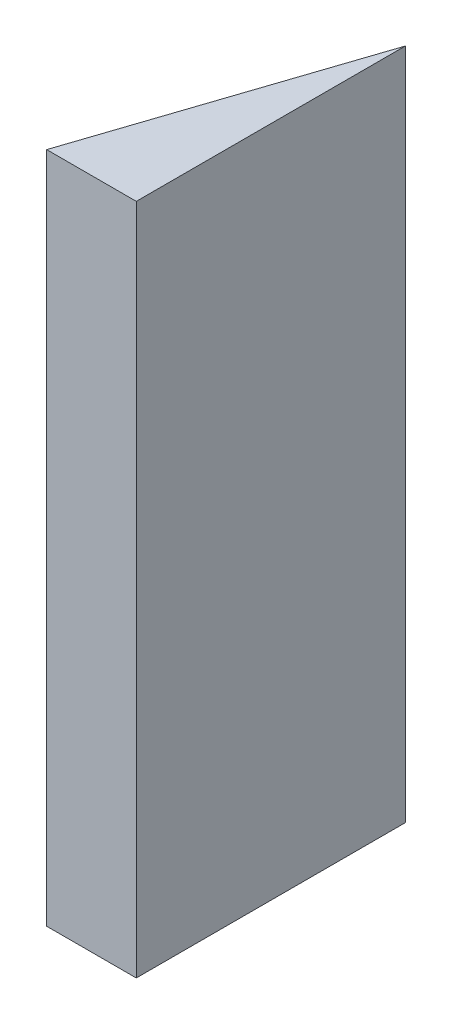
ISO-10303-21;
HEADER;
FILE_DESCRIPTION(('STEP AP214'),'2;1');
FILE_NAME('part.step','',(''),(''),'','','');
FILE_SCHEMA(('AUTOMOTIVE_DESIGN { 1 0 10303 214 1 1 1 1 }'));
ENDSEC;
DATA;
#1=APPLICATION_CONTEXT('core data for automotive mechanical design processes');
#2=APPLICATION_PROTOCOL_DEFINITION('international standard','automotive_design',2000,#1);
#3=PRODUCT_CONTEXT('',#1,'mechanical');
#4=PRODUCT('Part','Part','',(#3));
#5=PRODUCT_RELATED_PRODUCT_CATEGORY('part','',(#4));
#6=PRODUCT_DEFINITION_FORMATION('','',#4);
#7=PRODUCT_DEFINITION_CONTEXT('part definition',#1,'design');
#8=PRODUCT_DEFINITION('design','',#6,#7);
#9=PRODUCT_DEFINITION_SHAPE('','',#8);
#10=(LENGTH_UNIT() NAMED_UNIT(*) SI_UNIT(.MILLI.,.METRE.));
#11=(NAMED_UNIT(*) PLANE_ANGLE_UNIT() SI_UNIT($,.RADIAN.));
#12=(NAMED_UNIT(*) SI_UNIT($,.STERADIAN.) SOLID_ANGLE_UNIT());
#13=UNCERTAINTY_MEASURE_WITH_UNIT(LENGTH_MEASURE(1.E-05),#10,'distance_accuracy_value','');
#14=(GEOMETRIC_REPRESENTATION_CONTEXT(3) GLOBAL_UNCERTAINTY_ASSIGNED_CONTEXT((#13)) GLOBAL_UNIT_ASSIGNED_CONTEXT((#10,
#11,#12)) REPRESENTATION_CONTEXT('',''));
#15=CARTESIAN_POINT('',(0.,0.,0.));
#16=DIRECTION('',(0.,0.,1.));
#17=DIRECTION('',(1.,0.,0.));
#18=AXIS2_PLACEMENT_3D('',#15,#16,#17);
#19=CARTESIAN_POINT('',(3.92,-0.750000181838375,-3.67112158656318));
#20=DIRECTION('',(0.,1.,8.74227765734759E-08));
#21=DIRECTION('',(-1.,0.,0.));
#22=AXIS2_PLACEMENT_3D('',#19,#20,#21);
#23=PLANE('',#22);
#24=DIRECTION('',(-0.315990463967206,-8.29434405337929E-08,0.948762365759616));
#25=VECTOR('',#24,1.);
#26=CARTESIAN_POINT('',(3.9,-0.750000183586831,-3.65112158656318));
#27=LINE('',#26,#25);
#28=CARTESIAN_POINT('',(3.9,-0.750000183588831,-3.65112158656318));
#29=VERTEX_POINT('',#28);
#30=CARTESIAN_POINT('',(3.766777825356,-0.750000218557941,-3.25112158656318));
#31=VERTEX_POINT('',#30);
#32=EDGE_CURVE('E11',#29,#31,#27,.T.);
#33=ORIENTED_EDGE('',*,*,#32,.T.);
#34=DIRECTION('',(1.,0.,0.));
#35=VECTOR('',#34,1.);
#36=CARTESIAN_POINT('',(3.766777825356,-0.750000218555941,-3.25112158656318));
#37=LINE('',#36,#35);
#38=CARTESIAN_POINT('',(3.9,-0.750000218557941,-3.25112158656318));
#39=VERTEX_POINT('',#38);
#40=EDGE_CURVE('E49',#31,#39,#37,.T.);
#41=ORIENTED_EDGE('',*,*,#40,.T.);
#42=DIRECTION('',(0.,8.74227767955201E-08,-0.999999999999996));
#43=VECTOR('',#42,1.);
#44=CARTESIAN_POINT('',(3.9,-0.750000218555941,-3.25112158656318));
#45=LINE('',#44,#43);
#46=EDGE_CURVE('E47',#39,#29,#45,.T.);
#47=ORIENTED_EDGE('',*,*,#46,.T.);
#48=EDGE_LOOP('',(#33,#41,#47));
#49=FACE_BOUND('',#48,.T.);
#50=ADVANCED_FACE('F17',(#49),#23,.T.);
#51=CARTESIAN_POINT('',(3.92,-1.75000018183938,-3.67112167398595));
#52=DIRECTION('',(0.,1.,8.74227765734759E-08));
#53=DIRECTION('',(-1.,0.,0.));
#54=AXIS2_PLACEMENT_3D('',#51,#52,#53);
#55=PLANE('',#54);
#56=DIRECTION('',(0.,8.74227762404085E-08,-0.999999999999996));
#57=VECTOR('',#56,1.);
#58=CARTESIAN_POINT('',(3.9,-1.75000021855694,-3.25112167398595));
#59=LINE('',#58,#57);
#60=CARTESIAN_POINT('',(3.9,-1.75000021855594,-3.25112167398595));
#61=VERTEX_POINT('',#60);
#62=CARTESIAN_POINT('',(3.9,-1.75000018358683,-3.65112167398595));
#63=VERTEX_POINT('',#62);
#64=EDGE_CURVE('E24',#61,#63,#59,.T.);
#65=ORIENTED_EDGE('',*,*,#64,.F.);
#66=DIRECTION('',(1.,0.,0.));
#67=VECTOR('',#66,1.);
#68=CARTESIAN_POINT('',(3.766777825356,-1.75000021855694,-3.25112167398595));
#69=LINE('',#68,#67);
#70=CARTESIAN_POINT('',(3.766777825356,-1.75000021855594,-3.25112167398595));
#71=VERTEX_POINT('',#70);
#72=EDGE_CURVE('E53',#71,#61,#69,.T.);
#73=ORIENTED_EDGE('',*,*,#72,.F.);
#74=DIRECTION('',(-0.315990463967206,-8.2943440007124E-08,0.948762365759616));
#75=VECTOR('',#74,1.);
#76=CARTESIAN_POINT('',(3.9,-1.75000018358783,-3.65112167398595));
#77=LINE('',#76,#75);
#78=EDGE_CURVE('E68',#63,#71,#77,.T.);
#79=ORIENTED_EDGE('',*,*,#78,.F.);
#80=EDGE_LOOP('',(#65,#73,#79));
#81=FACE_BOUND('',#80,.T.);
#82=ADVANCED_FACE('F73',(#81),#55,.F.);
#83=CARTESIAN_POINT('',(3.9,-0.750000183586831,-3.65112158656318));
#84=DIRECTION('',(0.948762365759619,-2.76247637570875E-08,0.315990463967207));
#85=DIRECTION('',(-0.315990463967207,-8.29434403231256E-08,0.948762365759619));
#86=AXIS2_PLACEMENT_3D('',#83,#84,#85);
#87=PLANE('',#86);
#88=DIRECTION('',(0.,-0.999999999999996,-8.74227765733881E-08));
#89=VECTOR('',#88,1.);
#90=CARTESIAN_POINT('',(3.9,-0.750000183586831,-3.65112158656318));
#91=LINE('',#90,#89);
#92=EDGE_CURVE('E59',#29,#63,#91,.T.);
#93=ORIENTED_EDGE('',*,*,#92,.T.);
#94=ORIENTED_EDGE('',*,*,#78,.T.);
#95=DIRECTION('',(0.,-0.999999999999996,-8.74227765733881E-08));
#96=VECTOR('',#95,1.);
#97=CARTESIAN_POINT('',(3.766777825356,-0.750000218555941,-3.25112158656318));
#98=LINE('',#97,#96);
#99=EDGE_CURVE('E54',#31,#71,#98,.T.);
#100=ORIENTED_EDGE('',*,*,#99,.F.);
#101=ORIENTED_EDGE('',*,*,#32,.F.);
#102=EDGE_LOOP('',(#93,#94,#100,#101));
#103=FACE_BOUND('',#102,.T.);
#104=ADVANCED_FACE('F57',(#103),#87,.F.);
#105=CARTESIAN_POINT('',(3.766777825356,-0.750000218555941,-3.25112158656318));
#106=DIRECTION('',(0.,8.74227765734759E-08,-1.));
#107=DIRECTION('',(1.,0.,0.));
#108=AXIS2_PLACEMENT_3D('',#105,#106,#107);
#109=PLANE('',#108);
#110=ORIENTED_EDGE('',*,*,#99,.T.);
#111=ORIENTED_EDGE('',*,*,#72,.T.);
#112=DIRECTION('',(0.,-0.999999999999996,-8.74227765733881E-08));
#113=VECTOR('',#112,1.);
#114=CARTESIAN_POINT('',(3.9,-0.750000218555941,-3.25112158656318));
#115=LINE('',#114,#113);
#116=EDGE_CURVE('E70',#39,#61,#115,.T.);
#117=ORIENTED_EDGE('',*,*,#116,.F.);
#118=ORIENTED_EDGE('',*,*,#40,.F.);
#119=EDGE_LOOP('',(#110,#111,#117,#118));
#120=FACE_BOUND('',#119,.T.);
#121=ADVANCED_FACE('F72',(#120),#109,.F.);
#122=CARTESIAN_POINT('',(3.9,-0.750000218555941,-3.25112158656318));
#123=DIRECTION('',(-1.,0.,0.));
#124=DIRECTION('',(0.,8.74227765734759E-08,-1.));
#125=AXIS2_PLACEMENT_3D('',#122,#123,#124);
#126=PLANE('',#125);
#127=ORIENTED_EDGE('',*,*,#116,.T.);
#128=ORIENTED_EDGE('',*,*,#64,.T.);
#129=ORIENTED_EDGE('',*,*,#92,.F.);
#130=ORIENTED_EDGE('',*,*,#46,.F.);
#131=EDGE_LOOP('',(#127,#128,#129,#130));
#132=FACE_BOUND('',#131,.T.);
#133=ADVANCED_FACE('F61',(#132),#126,.F.);
#134=CLOSED_SHELL('',(#50,#82,#104,#121,#133));
#135=MANIFOLD_SOLID_BREP('B1',#134);
#136=ADVANCED_BREP_SHAPE_REPRESENTATION('',(#18,#135),#14);
#137=SHAPE_DEFINITION_REPRESENTATION(#9,#136);
ENDSEC;
END-ISO-10303-21;
